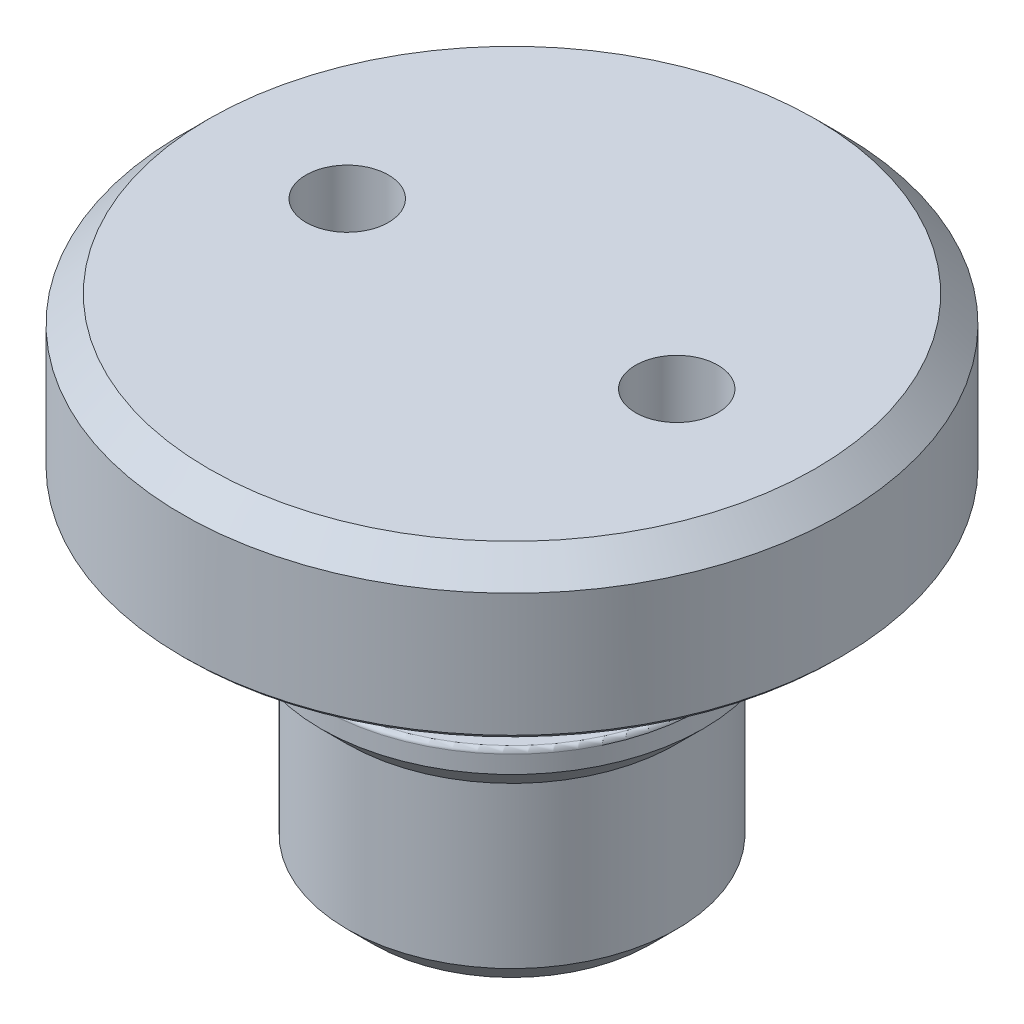
ISO-10303-21;
HEADER;
FILE_DESCRIPTION(('STEP AP214'),'2;1');
FILE_NAME('part.step','',(''),(''),'','','');
FILE_SCHEMA(('AUTOMOTIVE_DESIGN { 1 0 10303 214 1 1 1 1 }'));
ENDSEC;
DATA;
#1=APPLICATION_CONTEXT('core data for automotive mechanical design processes');
#2=APPLICATION_PROTOCOL_DEFINITION('international standard','automotive_design',2000,#1);
#3=PRODUCT_CONTEXT('',#1,'mechanical');
#4=PRODUCT('Part','Part','',(#3));
#5=PRODUCT_RELATED_PRODUCT_CATEGORY('part','',(#4));
#6=PRODUCT_DEFINITION_FORMATION('','',#4);
#7=PRODUCT_DEFINITION_CONTEXT('part definition',#1,'design');
#8=PRODUCT_DEFINITION('design','',#6,#7);
#9=PRODUCT_DEFINITION_SHAPE('','',#8);
#10=(LENGTH_UNIT() NAMED_UNIT(*) SI_UNIT(.MILLI.,.METRE.));
#11=(NAMED_UNIT(*) PLANE_ANGLE_UNIT() SI_UNIT($,.RADIAN.));
#12=(NAMED_UNIT(*) SI_UNIT($,.STERADIAN.) SOLID_ANGLE_UNIT());
#13=UNCERTAINTY_MEASURE_WITH_UNIT(LENGTH_MEASURE(1.E-05),#10,'distance_accuracy_value','');
#14=(GEOMETRIC_REPRESENTATION_CONTEXT(3) GLOBAL_UNCERTAINTY_ASSIGNED_CONTEXT((#13)) GLOBAL_UNIT_ASSIGNED_CONTEXT((#10,
#11,#12)) REPRESENTATION_CONTEXT('',''));
#15=CARTESIAN_POINT('',(0.,0.,0.));
#16=DIRECTION('',(0.,0.,1.));
#17=DIRECTION('',(1.,0.,0.));
#18=AXIS2_PLACEMENT_3D('',#15,#16,#17);
#19=CARTESIAN_POINT('',(1.905,6.35000000011132,0.));
#20=DIRECTION('',(0.,-1.,0.));
#21=DIRECTION('',(0.,0.,-1.));
#22=AXIS2_PLACEMENT_3D('',#19,#20,#21);
#23=CONICAL_SURFACE('',#22,1.13029999977243,1.02974425846957);
#24=CARTESIAN_POINT('',(1.905,7.0291527577524,8.5265128291212E-11));
#25=VERTEX_POINT('',#24);
#26=VERTEX_LOOP('',#25);
#27=FACE_BOUND('',#26,.T.);
#28=CARTESIAN_POINT('',(1.905,6.35,0.));
#29=DIRECTION('',(0.,-1.,0.));
#30=DIRECTION('',(0.,0.,-1.));
#31=AXIS2_PLACEMENT_3D('',#28,#29,#30);
#32=CIRCLE('',#31,1.1303);
#33=CARTESIAN_POINT('',(1.905,6.35,-1.1303));
#34=VERTEX_POINT('',#33);
#35=EDGE_CURVE('E353',#34,#34,#32,.T.);
#36=ORIENTED_EDGE('',*,*,#35,.T.);
#37=EDGE_LOOP('',(#36));
#38=FACE_BOUND('',#37,.T.);
#39=ADVANCED_FACE('F16',(#27,#38),#23,.F.);
#40=CARTESIAN_POINT('',(1.905,0.,0.));
#41=DIRECTION('',(0.,-1.,0.));
#42=DIRECTION('',(0.,0.,-1.));
#43=AXIS2_PLACEMENT_3D('',#40,#41,#42);
#44=CYLINDRICAL_SURFACE('',#43,1.1303);
#45=ORIENTED_EDGE('',*,*,#35,.F.);
#46=EDGE_LOOP('',(#45));
#47=FACE_BOUND('',#46,.T.);
#48=CARTESIAN_POINT('',(1.905,4.572,0.));
#49=DIRECTION('',(0.,-1.,0.));
#50=DIRECTION('',(0.,0.,-1.));
#51=AXIS2_PLACEMENT_3D('',#48,#49,#50);
#52=CIRCLE('',#51,1.1303);
#53=CARTESIAN_POINT('',(1.905,4.572,-1.1303));
#54=VERTEX_POINT('',#53);
#55=EDGE_CURVE('E350',#54,#54,#52,.T.);
#56=ORIENTED_EDGE('',*,*,#55,.T.);
#57=EDGE_LOOP('',(#56));
#58=FACE_BOUND('',#57,.T.);
#59=ADVANCED_FACE('F600',(#47,#58),#44,.F.);
#60=CARTESIAN_POINT('',(3.0353,4.572,0.));
#61=DIRECTION('',(0.,1.,0.));
#62=DIRECTION('',(0.,0.,1.));
#63=AXIS2_PLACEMENT_3D('',#60,#61,#62);
#64=PLANE('',#63);
#65=CARTESIAN_POINT('',(1.905,4.572,0.));
#66=DIRECTION('',(0.,-1.,0.));
#67=DIRECTION('',(0.,0.,-1.));
#68=AXIS2_PLACEMENT_3D('',#65,#66,#67);
#69=CIRCLE('',#68,1.4224);
#70=CARTESIAN_POINT('',(1.905,4.572,-1.4224));
#71=VERTEX_POINT('',#70);
#72=EDGE_CURVE('E347',#71,#71,#69,.T.);
#73=ORIENTED_EDGE('',*,*,#72,.T.);
#74=EDGE_LOOP('',(#73));
#75=FACE_BOUND('',#74,.T.);
#76=ORIENTED_EDGE('',*,*,#55,.F.);
#77=EDGE_LOOP('',(#76));
#78=FACE_BOUND('',#77,.T.);
#79=ADVANCED_FACE('F597',(#75,#78),#64,.F.);
#80=CARTESIAN_POINT('',(1.905,0.,0.));
#81=DIRECTION('',(0.,-1.,0.));
#82=DIRECTION('',(0.,0.,-1.));
#83=AXIS2_PLACEMENT_3D('',#80,#81,#82);
#84=CYLINDRICAL_SURFACE('',#83,1.4224);
#85=CARTESIAN_POINT('',(1.905,0.,0.));
#86=DIRECTION('',(0.,-1.,0.));
#87=DIRECTION('',(0.,0.,-1.));
#88=AXIS2_PLACEMENT_3D('',#85,#86,#87);
#89=CIRCLE('',#88,1.4224);
#90=CARTESIAN_POINT('',(1.905,0.,-1.4224));
#91=VERTEX_POINT('',#90);
#92=EDGE_CURVE('E344',#91,#91,#89,.F.);
#93=ORIENTED_EDGE('',*,*,#92,.F.);
#94=EDGE_LOOP('',(#93));
#95=FACE_BOUND('',#94,.T.);
#96=ORIENTED_EDGE('',*,*,#72,.F.);
#97=EDGE_LOOP('',(#96));
#98=FACE_BOUND('',#97,.T.);
#99=ADVANCED_FACE('F593',(#95,#98),#84,.F.);
#100=CARTESIAN_POINT('',(0.,0.,-4.7625));
#101=DIRECTION('',(0.,-1.,0.));
#102=DIRECTION('',(0.,0.,-1.));
#103=AXIS2_PLACEMENT_3D('',#100,#101,#102);
#104=PLANE('',#103);
#105=CARTESIAN_POINT('',(0.,0.,0.));
#106=DIRECTION('',(0.,1.,0.));
#107=DIRECTION('',(0.,0.,1.));
#108=AXIS2_PLACEMENT_3D('',#105,#106,#107);
#109=CIRCLE('',#108,4.00050000001784);
#110=CARTESIAN_POINT('',(0.,0.,4.00050000001784));
#111=VERTEX_POINT('',#110);
#112=EDGE_CURVE('E340',#111,#111,#109,.T.);
#113=ORIENTED_EDGE('',*,*,#112,.F.);
#114=EDGE_LOOP('',(#113));
#115=FACE_BOUND('',#114,.T.);
#116=ORIENTED_EDGE('',*,*,#92,.T.);
#117=EDGE_LOOP('',(#116));
#118=FACE_BOUND('',#117,.T.);
#119=ADVANCED_FACE('F589',(#115,#118),#104,.T.);
#120=CARTESIAN_POINT('',(0.,0.761999999951968,0.));
#121=DIRECTION('',(0.,1.,0.));
#122=DIRECTION('',(0.,0.,1.));
#123=AXIS2_PLACEMENT_3D('',#120,#121,#122);
#124=CONICAL_SURFACE('',#123,4.7624999999698,0.785398163397448);
#125=ORIENTED_EDGE('',*,*,#112,.T.);
#126=EDGE_LOOP('',(#125));
#127=FACE_BOUND('',#126,.T.);
#128=CARTESIAN_POINT('',(0.,0.761999999999999,0.));
#129=DIRECTION('',(0.,-1.,0.));
#130=DIRECTION('',(0.,0.,-1.));
#131=AXIS2_PLACEMENT_3D('',#128,#129,#130);
#132=CIRCLE('',#131,4.7625);
#133=CARTESIAN_POINT('',(0.,0.761999999999999,-4.7625));
#134=VERTEX_POINT('',#133);
#135=EDGE_CURVE('E343',#134,#134,#132,.F.);
#136=ORIENTED_EDGE('',*,*,#135,.F.);
#137=EDGE_LOOP('',(#136));
#138=FACE_BOUND('',#137,.T.);
#139=ADVANCED_FACE('F583',(#127,#138),#124,.T.);
#140=CARTESIAN_POINT('',(0.,0.,0.));
#141=DIRECTION('',(0.,-1.,0.));
#142=DIRECTION('',(0.,0.,-1.));
#143=AXIS2_PLACEMENT_3D('',#140,#141,#142);
#144=CYLINDRICAL_SURFACE('',#143,4.7625);
#145=CARTESIAN_POINT('',(0.,5.39750000001504,0.));
#146=DIRECTION('',(0.,1.,0.));
#147=DIRECTION('',(0.,0.,1.));
#148=AXIS2_PLACEMENT_3D('',#145,#146,#147);
#149=CIRCLE('',#148,4.76250000002665);
#150=CARTESIAN_POINT('',(0.,5.39750000001504,4.76250000002665));
#151=VERTEX_POINT('',#150);
#152=EDGE_CURVE('E553',#151,#151,#149,.T.);
#153=ORIENTED_EDGE('',*,*,#152,.F.);
#154=EDGE_LOOP('',(#153));
#155=FACE_BOUND('',#154,.T.);
#156=ORIENTED_EDGE('',*,*,#135,.T.);
#157=EDGE_LOOP('',(#156));
#158=FACE_BOUND('',#157,.T.);
#159=ADVANCED_FACE('F577',(#155,#158),#144,.T.);
#160=CARTESIAN_POINT('',(0.,6.15949999991017,0.));
#161=DIRECTION('',(0.,1.,0.));
#162=DIRECTION('',(0.,0.,1.));
#163=AXIS2_PLACEMENT_3D('',#160,#161,#162);
#164=CONICAL_SURFACE('',#163,5.52449999992177,0.785398163434747);
#165=ORIENTED_EDGE('',*,*,#152,.T.);
#166=EDGE_LOOP('',(#165));
#167=FACE_BOUND('',#166,.T.);
#168=CARTESIAN_POINT('',(0.,6.15950000000001,0.));
#169=DIRECTION('',(0.,-1.,0.));
#170=DIRECTION('',(0.,0.,-1.));
#171=AXIS2_PLACEMENT_3D('',#168,#169,#170);
#172=CIRCLE('',#171,5.5245);
#173=CARTESIAN_POINT('',(0.,6.15950000000001,-5.5245));
#174=VERTEX_POINT('',#173);
#175=EDGE_CURVE('E556',#174,#174,#172,.F.);
#176=ORIENTED_EDGE('',*,*,#175,.F.);
#177=EDGE_LOOP('',(#176));
#178=FACE_BOUND('',#177,.T.);
#179=ADVANCED_FACE('F573',(#167,#178),#164,.T.);
#180=CARTESIAN_POINT('',(0.,0.,0.));
#181=DIRECTION('',(0.,-1.,0.));
#182=DIRECTION('',(0.,0.,-1.));
#183=AXIS2_PLACEMENT_3D('',#180,#181,#182);
#184=CYLINDRICAL_SURFACE('',#183,5.5245);
#185=CARTESIAN_POINT('',(0.,6.6675,0.));
#186=DIRECTION('',(0.,1.,0.));
#187=DIRECTION('',(0.,0.,1.));
#188=AXIS2_PLACEMENT_3D('',#185,#186,#187);
#189=CIRCLE('',#188,5.5245);
#190=CARTESIAN_POINT('',(0.,6.6675,5.5245));
#191=VERTEX_POINT('',#190);
#192=EDGE_CURVE('E97',#191,#191,#189,.T.);
#193=ORIENTED_EDGE('',*,*,#192,.F.);
#194=EDGE_LOOP('',(#193));
#195=FACE_BOUND('',#194,.T.);
#196=ORIENTED_EDGE('',*,*,#175,.T.);
#197=EDGE_LOOP('',(#196));
#198=FACE_BOUND('',#197,.T.);
#199=ADVANCED_FACE('F570',(#195,#198),#184,.T.);
#200=CARTESIAN_POINT('',(0.,6.6675,0.));
#201=DIRECTION('',(0.,1.,0.));
#202=DIRECTION('',(0.,0.,1.));
#203=AXIS2_PLACEMENT_3D('',#200,#201,#202);
#204=TOROIDAL_SURFACE('',#203,5.3975,0.127);
#205=ORIENTED_EDGE('',*,*,#192,.T.);
#206=EDGE_LOOP('',(#205));
#207=FACE_BOUND('',#206,.T.);
#208=CARTESIAN_POINT('',(0.,6.7945,0.));
#209=DIRECTION('',(0.,-1.,0.));
#210=DIRECTION('',(0.,0.,1.));
#211=AXIS2_PLACEMENT_3D('',#208,#209,#210);
#212=CIRCLE('',#211,5.3975);
#213=CARTESIAN_POINT('',(0.,6.7945,-5.3975));
#214=VERTEX_POINT('',#213);
#215=CARTESIAN_POINT('',(0.,6.7945,5.3975));
#216=VERTEX_POINT('',#215);
#217=EDGE_CURVE('E84',#214,#216,#212,.F.);
#218=ORIENTED_EDGE('',*,*,#217,.F.);
#219=CARTESIAN_POINT('',(0.,6.7945,0.));
#220=DIRECTION('',(0.,-1.,0.));
#221=DIRECTION('',(0.,0.,-1.));
#222=AXIS2_PLACEMENT_3D('',#219,#220,#221);
#223=CIRCLE('',#222,5.3975);
#224=EDGE_CURVE('E88',#216,#214,#223,.F.);
#225=ORIENTED_EDGE('',*,*,#224,.F.);
#226=EDGE_LOOP('',(#218,#225));
#227=FACE_BOUND('',#226,.T.);
#228=ADVANCED_FACE('F87',(#207,#227),#204,.T.);
#229=CARTESIAN_POINT('',(0.,6.7945,-4.2799));
#230=DIRECTION('',(0.,1.,0.));
#231=DIRECTION('',(0.,0.,1.));
#232=AXIS2_PLACEMENT_3D('',#229,#230,#231);
#233=PLANE('',#232);
#234=ORIENTED_EDGE('',*,*,#224,.T.);
#235=ORIENTED_EDGE('',*,*,#217,.T.);
#236=EDGE_LOOP('',(#234,#235));
#237=FACE_BOUND('',#236,.T.);
#238=CARTESIAN_POINT('',(0.,6.7945,0.));
#239=DIRECTION('',(0.,1.,0.));
#240=DIRECTION('',(0.,0.,-1.));
#241=AXIS2_PLACEMENT_3D('',#238,#239,#240);
#242=CIRCLE('',#241,4.6609);
#243=CARTESIAN_POINT('',(0.,6.7945,4.6609));
#244=VERTEX_POINT('',#243);
#245=CARTESIAN_POINT('',(0.,6.7945,-4.6609));
#246=VERTEX_POINT('',#245);
#247=EDGE_CURVE('E91',#244,#246,#242,.F.);
#248=ORIENTED_EDGE('',*,*,#247,.T.);
#249=CARTESIAN_POINT('',(0.,6.7945,0.));
#250=DIRECTION('',(0.,1.,0.));
#251=DIRECTION('',(0.,0.,1.));
#252=AXIS2_PLACEMENT_3D('',#249,#250,#251);
#253=CIRCLE('',#252,4.6609);
#254=EDGE_CURVE('E140',#246,#244,#253,.F.);
#255=ORIENTED_EDGE('',*,*,#254,.T.);
#256=EDGE_LOOP('',(#248,#255));
#257=FACE_BOUND('',#256,.T.);
#258=ADVANCED_FACE('F95',(#237,#257),#233,.T.);
#259=CARTESIAN_POINT('',(0.,7.1755,0.));
#260=DIRECTION('',(0.,1.,0.));
#261=DIRECTION('',(0.,0.,1.));
#262=AXIS2_PLACEMENT_3D('',#259,#260,#261);
#263=TOROIDAL_SURFACE('',#262,4.6609,0.381);
#264=CARTESIAN_POINT('',(0.,7.1755,0.));
#265=DIRECTION('',(0.,-1.,0.));
#266=DIRECTION('',(0.,0.,-1.));
#267=AXIS2_PLACEMENT_3D('',#264,#265,#266);
#268=CIRCLE('',#267,4.2799);
#269=CARTESIAN_POINT('',(0.,7.1755,-4.2799));
#270=VERTEX_POINT('',#269);
#271=EDGE_CURVE('E150',#270,#270,#268,.F.);
#272=ORIENTED_EDGE('',*,*,#271,.F.);
#273=EDGE_LOOP('',(#272));
#274=FACE_BOUND('',#273,.T.);
#275=ORIENTED_EDGE('',*,*,#247,.F.);
#276=ORIENTED_EDGE('',*,*,#254,.F.);
#277=EDGE_LOOP('',(#275,#276));
#278=FACE_BOUND('',#277,.T.);
#279=ADVANCED_FACE('F115',(#274,#278),#263,.F.);
#280=CARTESIAN_POINT('',(0.,0.,0.));
#281=DIRECTION('',(0.,-1.,0.));
#282=DIRECTION('',(0.,0.,-1.));
#283=AXIS2_PLACEMENT_3D('',#280,#281,#282);
#284=CYLINDRICAL_SURFACE('',#283,4.2799);
#285=ORIENTED_EDGE('',*,*,#271,.T.);
#286=EDGE_LOOP('',(#285));
#287=FACE_BOUND('',#286,.T.);
#288=CARTESIAN_POINT('',(0.,8.8265,0.));
#289=DIRECTION('',(0.,-1.,0.));
#290=DIRECTION('',(0.,0.,-1.));
#291=AXIS2_PLACEMENT_3D('',#288,#289,#290);
#292=CIRCLE('',#291,4.2799);
#293=CARTESIAN_POINT('',(0.,8.8265,-4.2799));
#294=VERTEX_POINT('',#293);
#295=EDGE_CURVE('E152',#294,#294,#292,.T.);
#296=ORIENTED_EDGE('',*,*,#295,.T.);
#297=EDGE_LOOP('',(#296));
#298=FACE_BOUND('',#297,.T.);
#299=ADVANCED_FACE('F174',(#287,#298),#284,.T.);
#300=CARTESIAN_POINT('',(0.,8.8265,0.));
#301=DIRECTION('',(0.,-1.,0.));
#302=DIRECTION('',(0.,0.,-1.));
#303=AXIS2_PLACEMENT_3D('',#300,#301,#302);
#304=TOROIDAL_SURFACE('',#303,4.6609,0.381);
#305=ORIENTED_EDGE('',*,*,#295,.F.);
#306=EDGE_LOOP('',(#305));
#307=FACE_BOUND('',#306,.T.);
#308=CARTESIAN_POINT('',(0.,9.2075,0.));
#309=DIRECTION('',(0.,-1.,0.));
#310=DIRECTION('',(0.,0.,1.));
#311=AXIS2_PLACEMENT_3D('',#308,#309,#310);
#312=CIRCLE('',#311,4.6609);
#313=CARTESIAN_POINT('',(0.,9.2075,-4.6609));
#314=VERTEX_POINT('',#313);
#315=CARTESIAN_POINT('',(0.,9.2075,4.6609));
#316=VERTEX_POINT('',#315);
#317=EDGE_CURVE('E158',#314,#316,#312,.F.);
#318=ORIENTED_EDGE('',*,*,#317,.F.);
#319=CARTESIAN_POINT('',(0.,9.2075,0.));
#320=DIRECTION('',(0.,-1.,0.));
#321=DIRECTION('',(0.,0.,-1.));
#322=AXIS2_PLACEMENT_3D('',#319,#320,#321);
#323=CIRCLE('',#322,4.6609);
#324=EDGE_CURVE('E225',#316,#314,#323,.F.);
#325=ORIENTED_EDGE('',*,*,#324,.F.);
#326=EDGE_LOOP('',(#318,#325));
#327=FACE_BOUND('',#326,.T.);
#328=ADVANCED_FACE('F164',(#307,#327),#304,.F.);
#329=CARTESIAN_POINT('',(0.,9.2075,-5.5245));
#330=DIRECTION('',(0.,-1.,0.));
#331=DIRECTION('',(0.,0.,-1.));
#332=AXIS2_PLACEMENT_3D('',#329,#330,#331);
#333=PLANE('',#332);
#334=CARTESIAN_POINT('',(0.,9.2075,0.));
#335=DIRECTION('',(0.,1.,0.));
#336=DIRECTION('',(0.,0.,1.));
#337=AXIS2_PLACEMENT_3D('',#334,#335,#336);
#338=CIRCLE('',#337,5.3975);
#339=CARTESIAN_POINT('',(0.,9.2075,5.3975));
#340=VERTEX_POINT('',#339);
#341=CARTESIAN_POINT('',(0.,9.2075,-5.3975));
#342=VERTEX_POINT('',#341);
#343=EDGE_CURVE('E237',#340,#342,#338,.T.);
#344=ORIENTED_EDGE('',*,*,#343,.F.);
#345=CARTESIAN_POINT('',(0.,9.2075,0.));
#346=DIRECTION('',(0.,1.,0.));
#347=DIRECTION('',(0.,0.,-1.));
#348=AXIS2_PLACEMENT_3D('',#345,#346,#347);
#349=CIRCLE('',#348,5.3975);
#350=EDGE_CURVE('E211',#342,#340,#349,.T.);
#351=ORIENTED_EDGE('',*,*,#350,.F.);
#352=EDGE_LOOP('',(#344,#351));
#353=FACE_BOUND('',#352,.T.);
#354=ORIENTED_EDGE('',*,*,#317,.T.);
#355=ORIENTED_EDGE('',*,*,#324,.T.);
#356=EDGE_LOOP('',(#354,#355));
#357=FACE_BOUND('',#356,.T.);
#358=ADVANCED_FACE('F173',(#353,#357),#333,.T.);
#359=CARTESIAN_POINT('',(0.,9.3345,0.));
#360=DIRECTION('',(0.,-1.,0.));
#361=DIRECTION('',(0.,0.,-1.));
#362=AXIS2_PLACEMENT_3D('',#359,#360,#361);
#363=TOROIDAL_SURFACE('',#362,5.3975,0.127);
#364=CARTESIAN_POINT('',(0.,9.3345,0.));
#365=DIRECTION('',(0.,-1.,0.));
#366=DIRECTION('',(0.,0.,-1.));
#367=AXIS2_PLACEMENT_3D('',#364,#365,#366);
#368=CIRCLE('',#367,5.5245);
#369=CARTESIAN_POINT('',(0.,9.3345,-5.5245));
#370=VERTEX_POINT('',#369);
#371=EDGE_CURVE('E207',#370,#370,#368,.F.);
#372=ORIENTED_EDGE('',*,*,#371,.F.);
#373=EDGE_LOOP('',(#372));
#374=FACE_BOUND('',#373,.T.);
#375=ORIENTED_EDGE('',*,*,#350,.T.);
#376=ORIENTED_EDGE('',*,*,#343,.T.);
#377=EDGE_LOOP('',(#375,#376));
#378=FACE_BOUND('',#377,.T.);
#379=ADVANCED_FACE('F186',(#374,#378),#363,.T.);
#380=CARTESIAN_POINT('',(0.,0.,0.));
#381=DIRECTION('',(0.,-1.,0.));
#382=DIRECTION('',(0.,0.,-1.));
#383=AXIS2_PLACEMENT_3D('',#380,#381,#382);
#384=CYLINDRICAL_SURFACE('',#383,5.5245);
#385=CARTESIAN_POINT('',(0.,9.8425,0.));
#386=DIRECTION('',(0.,-1.,0.));
#387=DIRECTION('',(0.,0.,-1.));
#388=AXIS2_PLACEMENT_3D('',#385,#386,#387);
#389=CIRCLE('',#388,5.5245);
#390=CARTESIAN_POINT('',(0.,9.8425,-5.5245));
#391=VERTEX_POINT('',#390);
#392=EDGE_CURVE('E210',#391,#391,#389,.F.);
#393=ORIENTED_EDGE('',*,*,#392,.F.);
#394=EDGE_LOOP('',(#393));
#395=FACE_BOUND('',#394,.T.);
#396=ORIENTED_EDGE('',*,*,#371,.T.);
#397=EDGE_LOOP('',(#396));
#398=FACE_BOUND('',#397,.T.);
#399=ADVANCED_FACE('F196',(#395,#398),#384,.T.);
#400=CARTESIAN_POINT('',(0.,9.8425,-6.604));
#401=DIRECTION('',(0.,-1.,0.));
#402=DIRECTION('',(0.,0.,-1.));
#403=AXIS2_PLACEMENT_3D('',#400,#401,#402);
#404=PLANE('',#403);
#405=ORIENTED_EDGE('',*,*,#392,.T.);
#406=EDGE_LOOP('',(#405));
#407=FACE_BOUND('',#406,.T.);
#408=CARTESIAN_POINT('',(0.,9.8425,0.));
#409=DIRECTION('',(0.,1.,0.));
#410=DIRECTION('',(0.,0.,1.));
#411=AXIS2_PLACEMENT_3D('',#408,#409,#410);
#412=CIRCLE('',#411,6.477);
#413=CARTESIAN_POINT('',(0.,9.8425,6.477));
#414=VERTEX_POINT('',#413);
#415=CARTESIAN_POINT('',(0.,9.8425,-6.477));
#416=VERTEX_POINT('',#415);
#417=EDGE_CURVE('E311',#414,#416,#412,.T.);
#418=ORIENTED_EDGE('',*,*,#417,.F.);
#419=CARTESIAN_POINT('',(0.,9.8425,0.));
#420=DIRECTION('',(0.,1.,0.));
#421=DIRECTION('',(0.,0.,-1.));
#422=AXIS2_PLACEMENT_3D('',#419,#420,#421);
#423=CIRCLE('',#422,6.477);
#424=EDGE_CURVE('E321',#416,#414,#423,.T.);
#425=ORIENTED_EDGE('',*,*,#424,.F.);
#426=EDGE_LOOP('',(#418,#425));
#427=FACE_BOUND('',#426,.T.);
#428=ADVANCED_FACE('F297',(#407,#427),#404,.T.);
#429=CARTESIAN_POINT('',(0.,9.9695,0.));
#430=DIRECTION('',(0.,-1.,0.));
#431=DIRECTION('',(0.,0.,-1.));
#432=AXIS2_PLACEMENT_3D('',#429,#430,#431);
#433=TOROIDAL_SURFACE('',#432,6.477,0.127);
#434=ORIENTED_EDGE('',*,*,#424,.T.);
#435=ORIENTED_EDGE('',*,*,#417,.T.);
#436=EDGE_LOOP('',(#434,#435));
#437=FACE_BOUND('',#436,.T.);
#438=CARTESIAN_POINT('',(0.,9.9695,0.));
#439=DIRECTION('',(0.,-1.,0.));
#440=DIRECTION('',(0.,0.,-1.));
#441=AXIS2_PLACEMENT_3D('',#438,#439,#440);
#442=CIRCLE('',#441,6.604);
#443=CARTESIAN_POINT('',(0.,9.9695,-6.604));
#444=VERTEX_POINT('',#443);
#445=EDGE_CURVE('E305',#444,#444,#442,.F.);
#446=ORIENTED_EDGE('',*,*,#445,.F.);
#447=EDGE_LOOP('',(#446));
#448=FACE_BOUND('',#447,.T.);
#449=ADVANCED_FACE('F286',(#437,#448),#433,.T.);
#450=CARTESIAN_POINT('',(0.,0.,0.));
#451=DIRECTION('',(0.,-1.,0.));
#452=DIRECTION('',(0.,0.,-1.));
#453=AXIS2_PLACEMENT_3D('',#450,#451,#452);
#454=CYLINDRICAL_SURFACE('',#453,6.604);
#455=ORIENTED_EDGE('',*,*,#445,.T.);
#456=EDGE_LOOP('',(#455));
#457=FACE_BOUND('',#456,.T.);
#458=CARTESIAN_POINT('',(0.,10.7315,0.));
#459=DIRECTION('',(0.,-1.,0.));
#460=DIRECTION('',(0.,0.,-1.));
#461=AXIS2_PLACEMENT_3D('',#458,#459,#460);
#462=CIRCLE('',#461,6.604);
#463=CARTESIAN_POINT('',(0.,10.7315,-6.604));
#464=VERTEX_POINT('',#463);
#465=EDGE_CURVE('E331',#464,#464,#462,.T.);
#466=ORIENTED_EDGE('',*,*,#465,.T.);
#467=EDGE_LOOP('',(#466));
#468=FACE_BOUND('',#467,.T.);
#469=ADVANCED_FACE('F296',(#457,#468),#454,.T.);
#470=CARTESIAN_POINT('',(0.,10.7315,0.));
#471=DIRECTION('',(0.,-1.,0.));
#472=DIRECTION('',(0.,0.,-1.));
#473=AXIS2_PLACEMENT_3D('',#470,#471,#472);
#474=TOROIDAL_SURFACE('',#473,6.985,0.381);
#475=ORIENTED_EDGE('',*,*,#465,.F.);
#476=EDGE_LOOP('',(#475));
#477=FACE_BOUND('',#476,.T.);
#478=CARTESIAN_POINT('',(0.,11.1125,0.));
#479=DIRECTION('',(0.,-1.,0.));
#480=DIRECTION('',(0.,0.,1.));
#481=AXIS2_PLACEMENT_3D('',#478,#479,#480);
#482=CIRCLE('',#481,6.985);
#483=CARTESIAN_POINT('',(0.,11.1125,-6.985));
#484=VERTEX_POINT('',#483);
#485=CARTESIAN_POINT('',(0.,11.1125,6.985));
#486=VERTEX_POINT('',#485);
#487=EDGE_CURVE('E432',#484,#486,#482,.F.);
#488=ORIENTED_EDGE('',*,*,#487,.F.);
#489=CARTESIAN_POINT('',(0.,11.1125,0.));
#490=DIRECTION('',(0.,-1.,0.));
#491=DIRECTION('',(0.,0.,-1.));
#492=AXIS2_PLACEMENT_3D('',#489,#490,#491);
#493=CIRCLE('',#492,6.985);
#494=EDGE_CURVE('E449',#486,#484,#493,.F.);
#495=ORIENTED_EDGE('',*,*,#494,.F.);
#496=EDGE_LOOP('',(#488,#495));
#497=FACE_BOUND('',#496,.T.);
#498=ADVANCED_FACE('F436',(#477,#497),#474,.F.);
#499=CARTESIAN_POINT('',(0.,11.1125,-8.763));
#500=DIRECTION('',(0.,-1.,0.));
#501=DIRECTION('',(0.,0.,-1.));
#502=AXIS2_PLACEMENT_3D('',#499,#500,#501);
#503=PLANE('',#502);
#504=CARTESIAN_POINT('',(0.,11.1125,0.));
#505=DIRECTION('',(0.,1.,0.));
#506=DIRECTION('',(0.,0.,1.));
#507=AXIS2_PLACEMENT_3D('',#504,#505,#506);
#508=CIRCLE('',#507,8.382);
#509=CARTESIAN_POINT('',(0.,11.1125,-8.382));
#510=VERTEX_POINT('',#509);
#511=CARTESIAN_POINT('',(0.,11.1125,8.382));
#512=VERTEX_POINT('',#511);
#513=EDGE_CURVE('E405',#510,#512,#508,.F.);
#514=ORIENTED_EDGE('',*,*,#513,.T.);
#515=CARTESIAN_POINT('',(0.,11.1125,0.));
#516=DIRECTION('',(0.,1.,0.));
#517=DIRECTION('',(0.,0.,-1.));
#518=AXIS2_PLACEMENT_3D('',#515,#516,#517);
#519=CIRCLE('',#518,8.382);
#520=EDGE_CURVE('E461',#512,#510,#519,.F.);
#521=ORIENTED_EDGE('',*,*,#520,.T.);
#522=EDGE_LOOP('',(#514,#521));
#523=FACE_BOUND('',#522,.T.);
#524=ORIENTED_EDGE('',*,*,#487,.T.);
#525=ORIENTED_EDGE('',*,*,#494,.T.);
#526=EDGE_LOOP('',(#524,#525));
#527=FACE_BOUND('',#526,.T.);
#528=ADVANCED_FACE('F414',(#523,#527),#503,.T.);
#529=CARTESIAN_POINT('',(0.,10.7315,0.));
#530=DIRECTION('',(0.,-1.,0.));
#531=DIRECTION('',(0.,0.,-1.));
#532=AXIS2_PLACEMENT_3D('',#529,#530,#531);
#533=TOROIDAL_SURFACE('',#532,8.382,0.381);
#534=ORIENTED_EDGE('',*,*,#513,.F.);
#535=ORIENTED_EDGE('',*,*,#520,.F.);
#536=EDGE_LOOP('',(#534,#535));
#537=FACE_BOUND('',#536,.T.);
#538=CARTESIAN_POINT('',(0.,10.7315,0.));
#539=DIRECTION('',(0.,-1.,0.));
#540=DIRECTION('',(0.,0.,-1.));
#541=AXIS2_PLACEMENT_3D('',#538,#539,#540);
#542=CIRCLE('',#541,8.763);
#543=CARTESIAN_POINT('',(0.,10.7315,-8.763));
#544=VERTEX_POINT('',#543);
#545=EDGE_CURVE('E402',#544,#544,#542,.T.);
#546=ORIENTED_EDGE('',*,*,#545,.T.);
#547=EDGE_LOOP('',(#546));
#548=FACE_BOUND('',#547,.T.);
#549=ADVANCED_FACE('F410',(#537,#548),#533,.F.);
#550=CARTESIAN_POINT('',(0.,0.,0.));
#551=DIRECTION('',(0.,-1.,0.));
#552=DIRECTION('',(0.,0.,-1.));
#553=AXIS2_PLACEMENT_3D('',#550,#551,#552);
#554=CYLINDRICAL_SURFACE('',#553,8.763);
#555=ORIENTED_EDGE('',*,*,#545,.F.);
#556=EDGE_LOOP('',(#555));
#557=FACE_BOUND('',#556,.T.);
#558=CARTESIAN_POINT('',(0.,9.9695,0.));
#559=DIRECTION('',(0.,-1.,0.));
#560=DIRECTION('',(0.,0.,-1.));
#561=AXIS2_PLACEMENT_3D('',#558,#559,#560);
#562=CIRCLE('',#561,8.763);
#563=CARTESIAN_POINT('',(0.,9.9695,-8.763));
#564=VERTEX_POINT('',#563);
#565=EDGE_CURVE('E394',#564,#564,#562,.F.);
#566=ORIENTED_EDGE('',*,*,#565,.F.);
#567=EDGE_LOOP('',(#566));
#568=FACE_BOUND('',#567,.T.);
#569=ADVANCED_FACE('F377',(#557,#568),#554,.F.);
#570=CARTESIAN_POINT('',(0.,9.9695,0.));
#571=DIRECTION('',(0.,-1.,0.));
#572=DIRECTION('',(0.,0.,-1.));
#573=AXIS2_PLACEMENT_3D('',#570,#571,#572);
#574=TOROIDAL_SURFACE('',#573,8.89,0.127);
#575=ORIENTED_EDGE('',*,*,#565,.T.);
#576=EDGE_LOOP('',(#575));
#577=FACE_BOUND('',#576,.T.);
#578=CARTESIAN_POINT('',(0.,9.8425,0.));
#579=DIRECTION('',(0.,-1.,0.));
#580=DIRECTION('',(0.,0.,-1.));
#581=AXIS2_PLACEMENT_3D('',#578,#579,#580);
#582=CIRCLE('',#581,8.89);
#583=CARTESIAN_POINT('',(0.,9.8425,8.89));
#584=VERTEX_POINT('',#583);
#585=CARTESIAN_POINT('',(0.,9.8425,-8.89));
#586=VERTEX_POINT('',#585);
#587=EDGE_CURVE('E390',#584,#586,#582,.F.);
#588=ORIENTED_EDGE('',*,*,#587,.F.);
#589=CARTESIAN_POINT('',(0.,9.8425,0.));
#590=DIRECTION('',(0.,-1.,0.));
#591=DIRECTION('',(0.,0.,1.));
#592=AXIS2_PLACEMENT_3D('',#589,#590,#591);
#593=CIRCLE('',#592,8.89);
#594=EDGE_CURVE('E357',#586,#584,#593,.F.);
#595=ORIENTED_EDGE('',*,*,#594,.F.);
#596=EDGE_LOOP('',(#588,#595));
#597=FACE_BOUND('',#596,.T.);
#598=ADVANCED_FACE('F365',(#577,#597),#574,.T.);
#599=CARTESIAN_POINT('',(0.,9.8425,-9.525));
#600=DIRECTION('',(0.,-1.,0.));
#601=DIRECTION('',(0.,0.,-1.));
#602=AXIS2_PLACEMENT_3D('',#599,#600,#601);
#603=PLANE('',#602);
#604=ORIENTED_EDGE('',*,*,#594,.T.);
#605=ORIENTED_EDGE('',*,*,#587,.T.);
#606=EDGE_LOOP('',(#604,#605));
#607=FACE_BOUND('',#606,.T.);
#608=CARTESIAN_POINT('',(0.,9.8425,0.));
#609=DIRECTION('',(0.,1.,0.));
#610=DIRECTION('',(0.,0.,1.));
#611=AXIS2_PLACEMENT_3D('',#608,#609,#610);
#612=CIRCLE('',#611,9.398);
#613=CARTESIAN_POINT('',(0.,9.8425,9.398));
#614=VERTEX_POINT('',#613);
#615=EDGE_CURVE('E338',#614,#614,#612,.T.);
#616=ORIENTED_EDGE('',*,*,#615,.F.);
#617=EDGE_LOOP('',(#616));
#618=FACE_BOUND('',#617,.T.);
#619=ADVANCED_FACE('F376',(#607,#618),#603,.T.);
#620=CARTESIAN_POINT('',(0.,9.9695,0.));
#621=DIRECTION('',(0.,1.,0.));
#622=DIRECTION('',(0.,0.,1.));
#623=AXIS2_PLACEMENT_3D('',#620,#621,#622);
#624=CONICAL_SURFACE('',#623,9.525,0.785398163397462);
#625=CARTESIAN_POINT('',(0.,9.9695,0.));
#626=DIRECTION('',(0.,-1.,0.));
#627=DIRECTION('',(0.,0.,-1.));
#628=AXIS2_PLACEMENT_3D('',#625,#626,#627);
#629=CIRCLE('',#628,9.525);
#630=CARTESIAN_POINT('',(0.,9.9695,-9.525));
#631=VERTEX_POINT('',#630);
#632=EDGE_CURVE('E518',#631,#631,#629,.F.);
#633=ORIENTED_EDGE('',*,*,#632,.F.);
#634=EDGE_LOOP('',(#633));
#635=FACE_BOUND('',#634,.T.);
#636=ORIENTED_EDGE('',*,*,#615,.T.);
#637=EDGE_LOOP('',(#636));
#638=FACE_BOUND('',#637,.T.);
#639=ADVANCED_FACE('F507',(#635,#638),#624,.T.);
#640=CARTESIAN_POINT('',(-4.7625,11.1125000000243,0.));
#641=DIRECTION('',(0.,1.,0.));
#642=DIRECTION('',(0.,0.,1.));
#643=AXIS2_PLACEMENT_3D('',#640,#641,#642);
#644=CONICAL_SURFACE('',#643,1.19062500004929,1.02974425867532);
#645=CARTESIAN_POINT('',(-4.7625,10.3971003254344,-5.6843418860808E-11));
#646=VERTEX_POINT('',#645);
#647=VERTEX_LOOP('',#646);
#648=FACE_BOUND('',#647,.T.);
#649=CARTESIAN_POINT('',(-4.7625,11.1125,0.));
#650=DIRECTION('',(0.,1.,0.));
#651=DIRECTION('',(0.,0.,1.));
#652=AXIS2_PLACEMENT_3D('',#649,#650,#651);
#653=CIRCLE('',#652,1.190625);
#654=CARTESIAN_POINT('',(-4.7625,11.1125,1.190625));
#655=VERTEX_POINT('',#654);
#656=EDGE_CURVE('E522',#655,#655,#653,.T.);
#657=ORIENTED_EDGE('',*,*,#656,.T.);
#658=EDGE_LOOP('',(#657));
#659=FACE_BOUND('',#658,.T.);
#660=ADVANCED_FACE('F505',(#648,#659),#644,.F.);
#661=CARTESIAN_POINT('',(4.7625,11.1125000000243,0.));
#662=DIRECTION('',(0.,1.,0.));
#663=DIRECTION('',(0.,0.,1.));
#664=AXIS2_PLACEMENT_3D('',#661,#662,#663);
#665=CONICAL_SURFACE('',#664,1.19062500004929,1.02974425867532);
#666=CARTESIAN_POINT('',(4.7625,10.3971003254628,0.));
#667=VERTEX_POINT('',#666);
#668=VERTEX_LOOP('',#667);
#669=FACE_BOUND('',#668,.T.);
#670=CARTESIAN_POINT('',(4.7625,11.1125,0.));
#671=DIRECTION('',(0.,1.,0.));
#672=DIRECTION('',(0.,0.,1.));
#673=AXIS2_PLACEMENT_3D('',#670,#671,#672);
#674=CIRCLE('',#673,1.190625);
#675=CARTESIAN_POINT('',(4.7625,11.1125,1.190625));
#676=VERTEX_POINT('',#675);
#677=EDGE_CURVE('E536',#676,#676,#674,.T.);
#678=ORIENTED_EDGE('',*,*,#677,.T.);
#679=EDGE_LOOP('',(#678));
#680=FACE_BOUND('',#679,.T.);
#681=ADVANCED_FACE('F501',(#669,#680),#665,.F.);
#682=CARTESIAN_POINT('',(0.,0.,0.));
#683=DIRECTION('',(0.,-1.,0.));
#684=DIRECTION('',(0.,0.,-1.));
#685=AXIS2_PLACEMENT_3D('',#682,#683,#684);
#686=CYLINDRICAL_SURFACE('',#685,9.525);
#687=ORIENTED_EDGE('',*,*,#632,.T.);
#688=EDGE_LOOP('',(#687));
#689=FACE_BOUND('',#688,.T.);
#690=CARTESIAN_POINT('',(0.,13.5255,0.));
#691=DIRECTION('',(0.,-1.,0.));
#692=DIRECTION('',(0.,0.,-1.));
#693=AXIS2_PLACEMENT_3D('',#690,#691,#692);
#694=CIRCLE('',#693,9.525);
#695=CARTESIAN_POINT('',(0.,13.5255,-9.525));
#696=VERTEX_POINT('',#695);
#697=EDGE_CURVE('E539',#696,#696,#694,.F.);
#698=ORIENTED_EDGE('',*,*,#697,.F.);
#699=EDGE_LOOP('',(#698));
#700=FACE_BOUND('',#699,.T.);
#701=ADVANCED_FACE('F497',(#689,#700),#686,.T.);
#702=CARTESIAN_POINT('',(-4.7625,14.2875,0.));
#703=DIRECTION('',(0.,1.,0.));
#704=DIRECTION('',(0.,0.,1.));
#705=AXIS2_PLACEMENT_3D('',#702,#703,#704);
#706=CYLINDRICAL_SURFACE('',#705,1.190625);
#707=CARTESIAN_POINT('',(-4.7625,14.2875,0.));
#708=DIRECTION('',(0.,1.,0.));
#709=DIRECTION('',(0.,0.,1.));
#710=AXIS2_PLACEMENT_3D('',#707,#708,#709);
#711=CIRCLE('',#710,1.190625);
#712=CARTESIAN_POINT('',(-4.7625,14.2875,1.190625));
#713=VERTEX_POINT('',#712);
#714=EDGE_CURVE('E541',#713,#713,#711,.F.);
#715=ORIENTED_EDGE('',*,*,#714,.F.);
#716=EDGE_LOOP('',(#715));
#717=FACE_BOUND('',#716,.T.);
#718=ORIENTED_EDGE('',*,*,#656,.F.);
#719=EDGE_LOOP('',(#718));
#720=FACE_BOUND('',#719,.T.);
#721=ADVANCED_FACE('F493',(#717,#720),#706,.F.);
#722=CARTESIAN_POINT('',(4.7625,14.2875,0.));
#723=DIRECTION('',(0.,1.,0.));
#724=DIRECTION('',(0.,0.,1.));
#725=AXIS2_PLACEMENT_3D('',#722,#723,#724);
#726=CYLINDRICAL_SURFACE('',#725,1.190625);
#727=CARTESIAN_POINT('',(4.7625,14.2875,0.));
#728=DIRECTION('',(0.,1.,0.));
#729=DIRECTION('',(0.,0.,1.));
#730=AXIS2_PLACEMENT_3D('',#727,#728,#729);
#731=CIRCLE('',#730,1.190625);
#732=CARTESIAN_POINT('',(4.7625,14.2875,1.190625));
#733=VERTEX_POINT('',#732);
#734=EDGE_CURVE('E27',#733,#733,#731,.F.);
#735=ORIENTED_EDGE('',*,*,#734,.F.);
#736=EDGE_LOOP('',(#735));
#737=FACE_BOUND('',#736,.T.);
#738=ORIENTED_EDGE('',*,*,#677,.F.);
#739=EDGE_LOOP('',(#738));
#740=FACE_BOUND('',#739,.T.);
#741=ADVANCED_FACE('F486',(#737,#740),#726,.F.);
#742=CARTESIAN_POINT('',(0.,13.5255,0.));
#743=DIRECTION('',(0.,-1.,0.));
#744=DIRECTION('',(0.,0.,-1.));
#745=AXIS2_PLACEMENT_3D('',#742,#743,#744);
#746=CONICAL_SURFACE('',#745,9.525,0.785398163397451);
#747=ORIENTED_EDGE('',*,*,#697,.T.);
#748=EDGE_LOOP('',(#747));
#749=FACE_BOUND('',#748,.T.);
#750=CARTESIAN_POINT('',(0.,14.2875,0.));
#751=DIRECTION('',(0.,-1.,0.));
#752=DIRECTION('',(0.,0.,-1.));
#753=AXIS2_PLACEMENT_3D('',#750,#751,#752);
#754=CIRCLE('',#753,8.763);
#755=CARTESIAN_POINT('',(0.,14.2875,-8.763));
#756=VERTEX_POINT('',#755);
#757=EDGE_CURVE('E11',#756,#756,#754,.F.);
#758=ORIENTED_EDGE('',*,*,#757,.F.);
#759=EDGE_LOOP('',(#758));
#760=FACE_BOUND('',#759,.T.);
#761=ADVANCED_FACE('F480',(#749,#760),#746,.T.);
#762=CARTESIAN_POINT('',(0.,14.2875,0.));
#763=DIRECTION('',(0.,1.,0.));
#764=DIRECTION('',(0.,0.,1.));
#765=AXIS2_PLACEMENT_3D('',#762,#763,#764);
#766=PLANE('',#765);
#767=ORIENTED_EDGE('',*,*,#757,.T.);
#768=EDGE_LOOP('',(#767));
#769=FACE_BOUND('',#768,.T.);
#770=ORIENTED_EDGE('',*,*,#734,.T.);
#771=EDGE_LOOP('',(#770));
#772=FACE_BOUND('',#771,.T.);
#773=ORIENTED_EDGE('',*,*,#714,.T.);
#774=EDGE_LOOP('',(#773));
#775=FACE_BOUND('',#774,.T.);
#776=ADVANCED_FACE('F478',(#769,#772,#775),#766,.T.);
#777=CLOSED_SHELL('',(#39,#59,#79,#99,#119,#139,#159,#179,#199,#228,#258,#279,#299,#328,#358,
#379,#399,#428,#449,#469,#498,#528,#549,#569,#598,#619,#639,#660,#681,#701,#721,#741,#761,#776));
#778=MANIFOLD_SOLID_BREP('B1',#777);
#779=ADVANCED_BREP_SHAPE_REPRESENTATION('',(#18,#778),#14);
#780=SHAPE_DEFINITION_REPRESENTATION(#9,#779);
ENDSEC;
END-ISO-10303-21;
